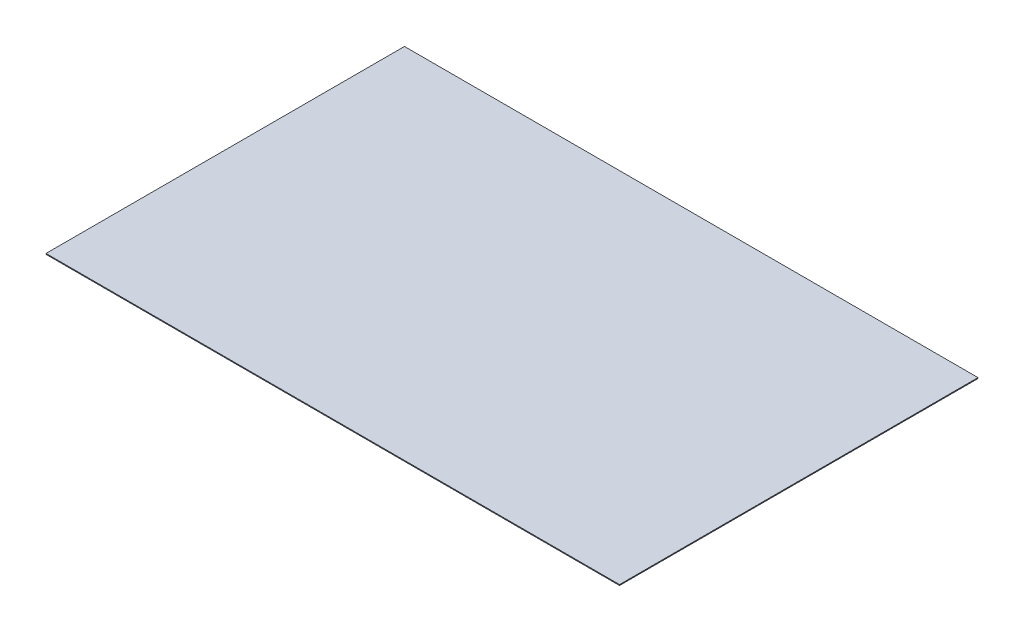
ISO-10303-21;
HEADER;
FILE_DESCRIPTION(('STEP AP214'),'2;1');
FILE_NAME('part.step','',(''),(''),'','','');
FILE_SCHEMA(('AUTOMOTIVE_DESIGN { 1 0 10303 214 1 1 1 1 }'));
ENDSEC;
DATA;
#1=APPLICATION_CONTEXT('core data for automotive mechanical design processes');
#2=APPLICATION_PROTOCOL_DEFINITION('international standard','automotive_design',2000,#1);
#3=PRODUCT_CONTEXT('',#1,'mechanical');
#4=PRODUCT('Part','Part','',(#3));
#5=PRODUCT_RELATED_PRODUCT_CATEGORY('part','',(#4));
#6=PRODUCT_DEFINITION_FORMATION('','',#4);
#7=PRODUCT_DEFINITION_CONTEXT('part definition',#1,'design');
#8=PRODUCT_DEFINITION('design','',#6,#7);
#9=PRODUCT_DEFINITION_SHAPE('','',#8);
#10=(LENGTH_UNIT() NAMED_UNIT(*) SI_UNIT(.MILLI.,.METRE.));
#11=(NAMED_UNIT(*) PLANE_ANGLE_UNIT() SI_UNIT($,.RADIAN.));
#12=(NAMED_UNIT(*) SI_UNIT($,.STERADIAN.) SOLID_ANGLE_UNIT());
#13=UNCERTAINTY_MEASURE_WITH_UNIT(LENGTH_MEASURE(1.E-05),#10,'distance_accuracy_value','');
#14=(GEOMETRIC_REPRESENTATION_CONTEXT(3) GLOBAL_UNCERTAINTY_ASSIGNED_CONTEXT((#13)) GLOBAL_UNIT_ASSIGNED_CONTEXT((#10,
#11,#12)) REPRESENTATION_CONTEXT('',''));
#15=CARTESIAN_POINT('',(0.,0.,0.));
#16=DIRECTION('',(0.,0.,1.));
#17=DIRECTION('',(1.,0.,0.));
#18=AXIS2_PLACEMENT_3D('',#15,#16,#17);
#19=CARTESIAN_POINT('',(203.2,-0.3048,127.));
#20=DIRECTION('',(-1.,0.,0.));
#21=DIRECTION('',(0.,0.,1.));
#22=AXIS2_PLACEMENT_3D('',#19,#20,#21);
#23=PLANE('',#22);
#24=DIRECTION('',(0.,1.,0.));
#25=VECTOR('',#24,1.);
#26=CARTESIAN_POINT('',(203.2,-0.3048,-127.));
#27=LINE('',#26,#25);
#28=CARTESIAN_POINT('',(203.2,-0.3048,-127.));
#29=VERTEX_POINT('',#28);
#30=CARTESIAN_POINT('',(203.2,0.3048,-127.));
#31=VERTEX_POINT('',#30);
#32=EDGE_CURVE('E112',#29,#31,#27,.T.);
#33=ORIENTED_EDGE('',*,*,#32,.T.);
#34=DIRECTION('',(0.,0.,-1.));
#35=VECTOR('',#34,1.);
#36=CARTESIAN_POINT('',(203.2,0.3048,127.));
#37=LINE('',#36,#35);
#38=CARTESIAN_POINT('',(203.2,0.3048,127.));
#39=VERTEX_POINT('',#38);
#40=EDGE_CURVE('E11',#39,#31,#37,.T.);
#41=ORIENTED_EDGE('',*,*,#40,.F.);
#42=DIRECTION('',(0.,1.,0.));
#43=VECTOR('',#42,1.);
#44=CARTESIAN_POINT('',(203.2,-0.3048,127.));
#45=LINE('',#44,#43);
#46=CARTESIAN_POINT('',(203.2,-0.3048,127.));
#47=VERTEX_POINT('',#46);
#48=EDGE_CURVE('E96',#47,#39,#45,.T.);
#49=ORIENTED_EDGE('',*,*,#48,.F.);
#50=DIRECTION('',(0.,0.,-1.));
#51=VECTOR('',#50,1.);
#52=CARTESIAN_POINT('',(203.2,-0.3048,127.));
#53=LINE('',#52,#51);
#54=EDGE_CURVE('E108',#47,#29,#53,.T.);
#55=ORIENTED_EDGE('',*,*,#54,.T.);
#56=EDGE_LOOP('',(#33,#41,#49,#55));
#57=FACE_BOUND('',#56,.T.);
#58=ADVANCED_FACE('F44',(#57),#23,.F.);
#59=CARTESIAN_POINT('',(-203.2,0.3048,127.));
#60=DIRECTION('',(0.,-1.,0.));
#61=DIRECTION('',(0.,0.,-1.));
#62=AXIS2_PLACEMENT_3D('',#59,#60,#61);
#63=PLANE('',#62);
#64=DIRECTION('',(-1.,0.,0.));
#65=VECTOR('',#64,1.);
#66=CARTESIAN_POINT('',(-203.2,0.3048,-127.));
#67=LINE('',#66,#65);
#68=CARTESIAN_POINT('',(-203.2,0.3048,-127.));
#69=VERTEX_POINT('',#68);
#70=EDGE_CURVE('E101',#31,#69,#67,.T.);
#71=ORIENTED_EDGE('',*,*,#70,.T.);
#72=DIRECTION('',(0.,0.,-1.));
#73=VECTOR('',#72,1.);
#74=CARTESIAN_POINT('',(-203.2,0.3048,127.));
#75=LINE('',#74,#73);
#76=CARTESIAN_POINT('',(-203.2,0.3048,127.));
#77=VERTEX_POINT('',#76);
#78=EDGE_CURVE('E53',#77,#69,#75,.T.);
#79=ORIENTED_EDGE('',*,*,#78,.F.);
#80=DIRECTION('',(-1.,0.,0.));
#81=VECTOR('',#80,1.);
#82=CARTESIAN_POINT('',(-203.2,0.3048,127.));
#83=LINE('',#82,#81);
#84=EDGE_CURVE('E91',#39,#77,#83,.T.);
#85=ORIENTED_EDGE('',*,*,#84,.F.);
#86=ORIENTED_EDGE('',*,*,#40,.T.);
#87=EDGE_LOOP('',(#71,#79,#85,#86));
#88=FACE_BOUND('',#87,.T.);
#89=ADVANCED_FACE('F100',(#88),#63,.F.);
#90=CARTESIAN_POINT('',(-203.2,-0.3048,127.));
#91=DIRECTION('',(1.,0.,0.));
#92=DIRECTION('',(0.,0.,-1.));
#93=AXIS2_PLACEMENT_3D('',#90,#91,#92);
#94=PLANE('',#93);
#95=DIRECTION('',(0.,-1.,0.));
#96=VECTOR('',#95,1.);
#97=CARTESIAN_POINT('',(-203.2,-0.3048,-127.));
#98=LINE('',#97,#96);
#99=CARTESIAN_POINT('',(-203.2,-0.3048,-127.));
#100=VERTEX_POINT('',#99);
#101=EDGE_CURVE('E78',#69,#100,#98,.T.);
#102=ORIENTED_EDGE('',*,*,#101,.T.);
#103=DIRECTION('',(0.,0.,-1.));
#104=VECTOR('',#103,1.);
#105=CARTESIAN_POINT('',(-203.2,-0.3048,127.));
#106=LINE('',#105,#104);
#107=CARTESIAN_POINT('',(-203.2,-0.3048,127.));
#108=VERTEX_POINT('',#107);
#109=EDGE_CURVE('E103',#108,#100,#106,.T.);
#110=ORIENTED_EDGE('',*,*,#109,.F.);
#111=DIRECTION('',(0.,-1.,0.));
#112=VECTOR('',#111,1.);
#113=CARTESIAN_POINT('',(-203.2,-0.3048,127.));
#114=LINE('',#113,#112);
#115=EDGE_CURVE('E94',#77,#108,#114,.T.);
#116=ORIENTED_EDGE('',*,*,#115,.F.);
#117=ORIENTED_EDGE('',*,*,#78,.T.);
#118=EDGE_LOOP('',(#102,#110,#116,#117));
#119=FACE_BOUND('',#118,.T.);
#120=ADVANCED_FACE('F104',(#119),#94,.F.);
#121=CARTESIAN_POINT('',(-203.2,-0.3048,127.));
#122=DIRECTION('',(0.,1.,0.));
#123=DIRECTION('',(0.,0.,1.));
#124=AXIS2_PLACEMENT_3D('',#121,#122,#123);
#125=PLANE('',#124);
#126=DIRECTION('',(1.,0.,0.));
#127=VECTOR('',#126,1.);
#128=CARTESIAN_POINT('',(-203.2,-0.3048,-127.));
#129=LINE('',#128,#127);
#130=EDGE_CURVE('E84',#100,#29,#129,.T.);
#131=ORIENTED_EDGE('',*,*,#130,.T.);
#132=ORIENTED_EDGE('',*,*,#54,.F.);
#133=DIRECTION('',(1.,0.,0.));
#134=VECTOR('',#133,1.);
#135=CARTESIAN_POINT('',(-203.2,-0.3048,127.));
#136=LINE('',#135,#134);
#137=EDGE_CURVE('E61',#108,#47,#136,.T.);
#138=ORIENTED_EDGE('',*,*,#137,.F.);
#139=ORIENTED_EDGE('',*,*,#109,.T.);
#140=EDGE_LOOP('',(#131,#132,#138,#139));
#141=FACE_BOUND('',#140,.T.);
#142=ADVANCED_FACE('F125',(#141),#125,.F.);
#143=CARTESIAN_POINT('',(0.,0.,127.));
#144=DIRECTION('',(0.,0.,-1.));
#145=DIRECTION('',(-1.,0.,0.));
#146=AXIS2_PLACEMENT_3D('',#143,#144,#145);
#147=PLANE('',#146);
#148=ORIENTED_EDGE('',*,*,#48,.T.);
#149=ORIENTED_EDGE('',*,*,#84,.T.);
#150=ORIENTED_EDGE('',*,*,#115,.T.);
#151=ORIENTED_EDGE('',*,*,#137,.T.);
#152=EDGE_LOOP('',(#148,#149,#150,#151));
#153=FACE_BOUND('',#152,.T.);
#154=ADVANCED_FACE('F92',(#153),#147,.F.);
#155=CARTESIAN_POINT('',(0.,0.,-127.));
#156=DIRECTION('',(0.,0.,-1.));
#157=DIRECTION('',(-1.,0.,0.));
#158=AXIS2_PLACEMENT_3D('',#155,#156,#157);
#159=PLANE('',#158);
#160=ORIENTED_EDGE('',*,*,#32,.F.);
#161=ORIENTED_EDGE('',*,*,#130,.F.);
#162=ORIENTED_EDGE('',*,*,#101,.F.);
#163=ORIENTED_EDGE('',*,*,#70,.F.);
#164=EDGE_LOOP('',(#160,#161,#162,#163));
#165=FACE_BOUND('',#164,.T.);
#166=ADVANCED_FACE('F128',(#165),#159,.T.);
#167=CLOSED_SHELL('',(#58,#89,#120,#142,#154,#166));
#168=MANIFOLD_SOLID_BREP('B2',#167);
#169=ADVANCED_BREP_SHAPE_REPRESENTATION('',(#18,#168),#14);
#170=SHAPE_DEFINITION_REPRESENTATION(#9,#169);
ENDSEC;
END-ISO-10303-21;
